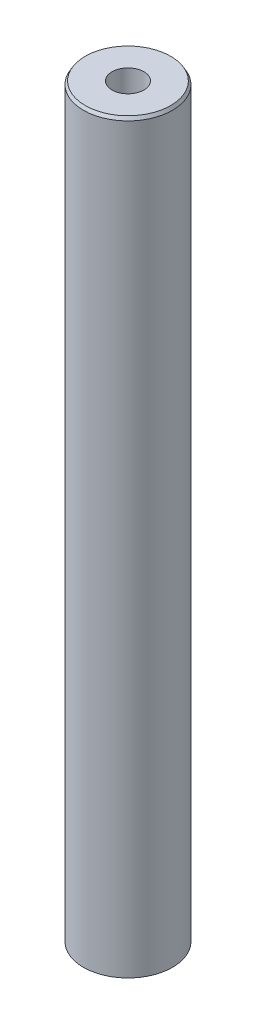
ISO-10303-21;
HEADER;
FILE_DESCRIPTION(('STEP AP214'),'2;1');
FILE_NAME('part.step','',(''),(''),'','','');
FILE_SCHEMA(('AUTOMOTIVE_DESIGN { 1 0 10303 214 1 1 1 1 }'));
ENDSEC;
DATA;
#1=APPLICATION_CONTEXT('core data for automotive mechanical design processes');
#2=APPLICATION_PROTOCOL_DEFINITION('international standard','automotive_design',2000,#1);
#3=PRODUCT_CONTEXT('',#1,'mechanical');
#4=PRODUCT('Part','Part','',(#3));
#5=PRODUCT_RELATED_PRODUCT_CATEGORY('part','',(#4));
#6=PRODUCT_DEFINITION_FORMATION('','',#4);
#7=PRODUCT_DEFINITION_CONTEXT('part definition',#1,'design');
#8=PRODUCT_DEFINITION('design','',#6,#7);
#9=PRODUCT_DEFINITION_SHAPE('','',#8);
#10=(LENGTH_UNIT() NAMED_UNIT(*) SI_UNIT(.MILLI.,.METRE.));
#11=(NAMED_UNIT(*) PLANE_ANGLE_UNIT() SI_UNIT($,.RADIAN.));
#12=(NAMED_UNIT(*) SI_UNIT($,.STERADIAN.) SOLID_ANGLE_UNIT());
#13=UNCERTAINTY_MEASURE_WITH_UNIT(LENGTH_MEASURE(1.E-05),#10,'distance_accuracy_value','');
#14=(GEOMETRIC_REPRESENTATION_CONTEXT(3) GLOBAL_UNCERTAINTY_ASSIGNED_CONTEXT((#13)) GLOBAL_UNIT_ASSIGNED_CONTEXT((#10,
#11,#12)) REPRESENTATION_CONTEXT('',''));
#15=CARTESIAN_POINT('',(0.,0.,0.));
#16=DIRECTION('',(0.,0.,1.));
#17=DIRECTION('',(1.,0.,0.));
#18=AXIS2_PLACEMENT_3D('',#15,#16,#17);
#19=CARTESIAN_POINT('',(0.,419.238946514623,0.));
#20=DIRECTION('',(0.,-1.,0.));
#21=DIRECTION('',(0.,0.,-1.));
#22=AXIS2_PLACEMENT_3D('',#19,#20,#21);
#23=CYLINDRICAL_SURFACE('',#22,25.);
#24=CARTESIAN_POINT('',(0.,417.451795150705,0.));
#25=DIRECTION('',(0.,1.,0.));
#26=DIRECTION('',(0.,0.,1.));
#27=AXIS2_PLACEMENT_3D('',#24,#25,#26);
#28=CIRCLE('',#27,25.);
#29=CARTESIAN_POINT('',(0.,417.451795150705,25.));
#30=VERTEX_POINT('',#29);
#31=EDGE_CURVE('E50',#30,#30,#28,.F.);
#32=ORIENTED_EDGE('',*,*,#31,.T.);
#33=EDGE_LOOP('',(#32));
#34=FACE_BOUND('',#33,.T.);
#35=CARTESIAN_POINT('',(0.,1.03181232104083,0.));
#36=DIRECTION('',(0.,1.,0.));
#37=DIRECTION('',(0.,0.,1.));
#38=AXIS2_PLACEMENT_3D('',#35,#36,#37);
#39=CIRCLE('',#38,25.);
#40=CARTESIAN_POINT('',(0.,1.03181232104083,25.));
#41=VERTEX_POINT('',#40);
#42=EDGE_CURVE('E51',#41,#41,#39,.T.);
#43=ORIENTED_EDGE('',*,*,#42,.T.);
#44=EDGE_LOOP('',(#43));
#45=FACE_BOUND('',#44,.T.);
#46=ADVANCED_FACE('F39',(#34,#45),#23,.T.);
#47=CARTESIAN_POINT('',(0.,419.238946514623,0.));
#48=DIRECTION('',(0.,1.,0.));
#49=DIRECTION('',(0.,0.,1.));
#50=AXIS2_PLACEMENT_3D('',#47,#48,#49);
#51=PLANE('',#50);
#52=CARTESIAN_POINT('',(0.,419.238946514623,0.));
#53=DIRECTION('',(0.,1.,0.));
#54=DIRECTION('',(0.,0.,1.));
#55=AXIS2_PLACEMENT_3D('',#52,#53,#54);
#56=CIRCLE('',#55,23.9681876789592);
#57=CARTESIAN_POINT('',(0.,419.238946514623,23.9681876789592));
#58=VERTEX_POINT('',#57);
#59=EDGE_CURVE('E54',#58,#58,#56,.T.);
#60=ORIENTED_EDGE('',*,*,#59,.T.);
#61=EDGE_LOOP('',(#60));
#62=FACE_BOUND('',#61,.T.);
#63=CARTESIAN_POINT('',(0.,419.238946514623,0.));
#64=DIRECTION('',(0.,1.,0.));
#65=DIRECTION('',(0.,0.,1.));
#66=AXIS2_PLACEMENT_3D('',#63,#64,#65);
#67=CIRCLE('',#66,8.91934893421981);
#68=CARTESIAN_POINT('',(0.,419.238946514623,8.91934893421981));
#69=VERTEX_POINT('',#68);
#70=EDGE_CURVE('E58',#69,#69,#67,.T.);
#71=ORIENTED_EDGE('',*,*,#70,.F.);
#72=EDGE_LOOP('',(#71));
#73=FACE_BOUND('',#72,.T.);
#74=ADVANCED_FACE('F69',(#62,#73),#51,.T.);
#75=CARTESIAN_POINT('',(0.,0.,0.));
#76=DIRECTION('',(0.,1.,0.));
#77=DIRECTION('',(0.,0.,1.));
#78=AXIS2_PLACEMENT_3D('',#75,#76,#77);
#79=PLANE('',#78);
#80=CARTESIAN_POINT('',(0.,0.,0.));
#81=DIRECTION('',(0.,1.,0.));
#82=DIRECTION('',(0.,0.,1.));
#83=AXIS2_PLACEMENT_3D('',#80,#81,#82);
#84=CIRCLE('',#83,23.2128486360817);
#85=CARTESIAN_POINT('',(0.,0.,23.2128486360817));
#86=VERTEX_POINT('',#85);
#87=EDGE_CURVE('E10',#86,#86,#84,.F.);
#88=ORIENTED_EDGE('',*,*,#87,.T.);
#89=EDGE_LOOP('',(#88));
#90=FACE_BOUND('',#89,.T.);
#91=CARTESIAN_POINT('',(0.,0.,0.));
#92=DIRECTION('',(0.,1.,0.));
#93=DIRECTION('',(0.,0.,1.));
#94=AXIS2_PLACEMENT_3D('',#91,#92,#93);
#95=CIRCLE('',#94,8.91934893421981);
#96=CARTESIAN_POINT('',(0.,0.,8.91934893421981));
#97=VERTEX_POINT('',#96);
#98=EDGE_CURVE('E63',#97,#97,#95,.T.);
#99=ORIENTED_EDGE('',*,*,#98,.T.);
#100=EDGE_LOOP('',(#99));
#101=FACE_BOUND('',#100,.T.);
#102=ADVANCED_FACE('F75',(#90,#101),#79,.F.);
#103=CARTESIAN_POINT('',(0.,419.238946514623,0.));
#104=DIRECTION('',(0.,-1.,0.));
#105=DIRECTION('',(0.,0.,-1.));
#106=AXIS2_PLACEMENT_3D('',#103,#104,#105);
#107=CYLINDRICAL_SURFACE('',#106,8.91934893421981);
#108=ORIENTED_EDGE('',*,*,#70,.T.);
#109=EDGE_LOOP('',(#108));
#110=FACE_BOUND('',#109,.T.);
#111=ORIENTED_EDGE('',*,*,#98,.F.);
#112=EDGE_LOOP('',(#111));
#113=FACE_BOUND('',#112,.T.);
#114=ADVANCED_FACE('F70',(#110,#113),#107,.F.);
#115=CARTESIAN_POINT('',(0.,419.238946514623,0.));
#116=DIRECTION('',(0.,-1.,0.));
#117=DIRECTION('',(0.,0.,-1.));
#118=AXIS2_PLACEMENT_3D('',#115,#116,#117);
#119=CONICAL_SURFACE('',#118,23.9681876789592,0.523598775598306);
#120=ORIENTED_EDGE('',*,*,#31,.F.);
#121=EDGE_LOOP('',(#120));
#122=FACE_BOUND('',#121,.T.);
#123=ORIENTED_EDGE('',*,*,#59,.F.);
#124=EDGE_LOOP('',(#123));
#125=FACE_BOUND('',#124,.T.);
#126=ADVANCED_FACE('F81',(#122,#125),#119,.T.);
#127=CARTESIAN_POINT('',(0.,1.03181232104083,0.));
#128=DIRECTION('',(0.,1.,0.));
#129=DIRECTION('',(0.,0.,1.));
#130=AXIS2_PLACEMENT_3D('',#127,#128,#129);
#131=CONICAL_SURFACE('',#130,25.,1.0471975511966);
#132=ORIENTED_EDGE('',*,*,#87,.F.);
#133=EDGE_LOOP('',(#132));
#134=FACE_BOUND('',#133,.T.);
#135=ORIENTED_EDGE('',*,*,#42,.F.);
#136=EDGE_LOOP('',(#135));
#137=FACE_BOUND('',#136,.T.);
#138=ADVANCED_FACE('F45',(#134,#137),#131,.T.);
#139=CLOSED_SHELL('',(#46,#74,#102,#114,#126,#138));
#140=MANIFOLD_SOLID_BREP('B2',#139);
#141=ADVANCED_BREP_SHAPE_REPRESENTATION('',(#18,#140),#14);
#142=SHAPE_DEFINITION_REPRESENTATION(#9,#141);
ENDSEC;
END-ISO-10303-21;
